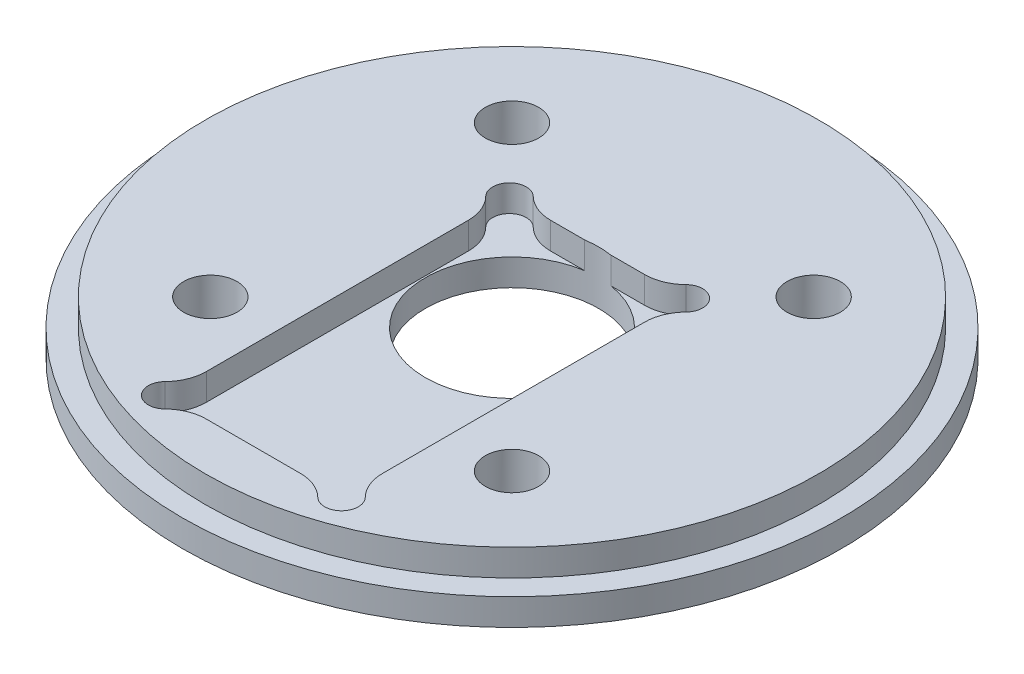
ISO-10303-21;
HEADER;
FILE_DESCRIPTION(('STEP AP214'),'2;1');
FILE_NAME('part.step','',(''),(''),'','','');
FILE_SCHEMA(('AUTOMOTIVE_DESIGN { 1 0 10303 214 1 1 1 1 }'));
ENDSEC;
DATA;
#1=APPLICATION_CONTEXT('core data for automotive mechanical design processes');
#2=APPLICATION_PROTOCOL_DEFINITION('international standard','automotive_design',2000,#1);
#3=PRODUCT_CONTEXT('',#1,'mechanical');
#4=PRODUCT('Part','Part','',(#3));
#5=PRODUCT_RELATED_PRODUCT_CATEGORY('part','',(#4));
#6=PRODUCT_DEFINITION_FORMATION('','',#4);
#7=PRODUCT_DEFINITION_CONTEXT('part definition',#1,'design');
#8=PRODUCT_DEFINITION('design','',#6,#7);
#9=PRODUCT_DEFINITION_SHAPE('','',#8);
#10=(LENGTH_UNIT() NAMED_UNIT(*) SI_UNIT(.MILLI.,.METRE.));
#11=(NAMED_UNIT(*) PLANE_ANGLE_UNIT() SI_UNIT($,.RADIAN.));
#12=(NAMED_UNIT(*) SI_UNIT($,.STERADIAN.) SOLID_ANGLE_UNIT());
#13=UNCERTAINTY_MEASURE_WITH_UNIT(LENGTH_MEASURE(1.E-05),#10,'distance_accuracy_value','');
#14=(GEOMETRIC_REPRESENTATION_CONTEXT(3) GLOBAL_UNCERTAINTY_ASSIGNED_CONTEXT((#13)) GLOBAL_UNIT_ASSIGNED_CONTEXT((#10,
#11,#12)) REPRESENTATION_CONTEXT('',''));
#15=CARTESIAN_POINT('',(0.,0.,0.));
#16=DIRECTION('',(0.,0.,1.));
#17=DIRECTION('',(1.,0.,0.));
#18=AXIS2_PLACEMENT_3D('',#15,#16,#17);
#19=CARTESIAN_POINT('',(-17.9605122421381,6.35,-17.9605122421386));
#20=DIRECTION('',(0.,1.,0.));
#21=DIRECTION('',(0.,0.,1.));
#22=AXIS2_PLACEMENT_3D('',#19,#20,#21);
#23=CYLINDRICAL_SURFACE('',#22,3.175);
#24=CARTESIAN_POINT('',(-17.9605122421381,6.35,-17.9605122421386));
#25=DIRECTION('',(0.,1.,0.));
#26=DIRECTION('',(0.,0.,1.));
#27=AXIS2_PLACEMENT_3D('',#24,#25,#26);
#28=CIRCLE('',#27,3.175);
#29=CARTESIAN_POINT('',(-17.9605122421381,6.35,-14.7855122421386));
#30=VERTEX_POINT('',#29);
#31=EDGE_CURVE('E320',#30,#30,#28,.T.);
#32=ORIENTED_EDGE('',*,*,#31,.T.);
#33=EDGE_LOOP('',(#32));
#34=FACE_BOUND('',#33,.T.);
#35=CARTESIAN_POINT('',(-17.9605122421381,1.5875,-17.9605122421386));
#36=DIRECTION('',(0.,-1.,0.));
#37=DIRECTION('',(0.,0.,-1.));
#38=AXIS2_PLACEMENT_3D('',#35,#36,#37);
#39=CIRCLE('',#38,3.175);
#40=CARTESIAN_POINT('',(-17.9605122421381,1.5875,-21.1355122421386));
#41=VERTEX_POINT('',#40);
#42=EDGE_CURVE('E43',#41,#41,#39,.F.);
#43=ORIENTED_EDGE('',*,*,#42,.F.);
#44=EDGE_LOOP('',(#43));
#45=FACE_BOUND('',#44,.T.);
#46=ADVANCED_FACE('F39',(#34,#45),#23,.F.);
#47=CARTESIAN_POINT('',(17.9605122421384,6.35,17.9605122421382));
#48=DIRECTION('',(0.,1.,0.));
#49=DIRECTION('',(0.,0.,1.));
#50=AXIS2_PLACEMENT_3D('',#47,#48,#49);
#51=CYLINDRICAL_SURFACE('',#50,3.175);
#52=CARTESIAN_POINT('',(17.9605122421384,6.35,17.9605122421382));
#53=DIRECTION('',(0.,1.,0.));
#54=DIRECTION('',(0.,0.,1.));
#55=AXIS2_PLACEMENT_3D('',#52,#53,#54);
#56=CIRCLE('',#55,3.175);
#57=CARTESIAN_POINT('',(17.9605122421384,6.35,21.1355122421382));
#58=VERTEX_POINT('',#57);
#59=EDGE_CURVE('E317',#58,#58,#56,.T.);
#60=ORIENTED_EDGE('',*,*,#59,.T.);
#61=EDGE_LOOP('',(#60));
#62=FACE_BOUND('',#61,.T.);
#63=CARTESIAN_POINT('',(17.9605122421384,1.5875,17.9605122421382));
#64=DIRECTION('',(0.,-1.,0.));
#65=DIRECTION('',(0.,0.,-1.));
#66=AXIS2_PLACEMENT_3D('',#63,#64,#65);
#67=CIRCLE('',#66,3.175);
#68=CARTESIAN_POINT('',(17.9605122421384,1.5875,14.7855122421382));
#69=VERTEX_POINT('',#68);
#70=EDGE_CURVE('E344',#69,#69,#67,.F.);
#71=ORIENTED_EDGE('',*,*,#70,.F.);
#72=EDGE_LOOP('',(#71));
#73=FACE_BOUND('',#72,.T.);
#74=ADVANCED_FACE('F354',(#62,#73),#51,.F.);
#75=CARTESIAN_POINT('',(17.9605122421386,6.35,-17.960512242138));
#76=DIRECTION('',(0.,1.,0.));
#77=DIRECTION('',(0.,0.,1.));
#78=AXIS2_PLACEMENT_3D('',#75,#76,#77);
#79=CYLINDRICAL_SURFACE('',#78,3.175);
#80=CARTESIAN_POINT('',(17.9605122421386,6.35,-17.960512242138));
#81=DIRECTION('',(0.,1.,0.));
#82=DIRECTION('',(0.,0.,1.));
#83=AXIS2_PLACEMENT_3D('',#80,#81,#82);
#84=CIRCLE('',#83,3.175);
#85=CARTESIAN_POINT('',(17.9605122421386,6.35,-14.785512242138));
#86=VERTEX_POINT('',#85);
#87=EDGE_CURVE('E314',#86,#86,#84,.T.);
#88=ORIENTED_EDGE('',*,*,#87,.T.);
#89=EDGE_LOOP('',(#88));
#90=FACE_BOUND('',#89,.T.);
#91=CARTESIAN_POINT('',(17.9605122421386,1.5875,-17.960512242138));
#92=DIRECTION('',(0.,-1.,0.));
#93=DIRECTION('',(0.,0.,-1.));
#94=AXIS2_PLACEMENT_3D('',#91,#92,#93);
#95=CIRCLE('',#94,3.175);
#96=CARTESIAN_POINT('',(17.9605122421386,1.5875,-21.135512242138));
#97=VERTEX_POINT('',#96);
#98=EDGE_CURVE('E341',#97,#97,#95,.F.);
#99=ORIENTED_EDGE('',*,*,#98,.F.);
#100=EDGE_LOOP('',(#99));
#101=FACE_BOUND('',#100,.T.);
#102=ADVANCED_FACE('F361',(#90,#101),#79,.F.);
#103=CARTESIAN_POINT('',(-17.9605122421382,6.35,17.9605122421384));
#104=DIRECTION('',(0.,1.,0.));
#105=DIRECTION('',(0.,0.,1.));
#106=AXIS2_PLACEMENT_3D('',#103,#104,#105);
#107=CYLINDRICAL_SURFACE('',#106,3.175);
#108=CARTESIAN_POINT('',(-17.9605122421382,6.35,17.9605122421384));
#109=DIRECTION('',(0.,1.,0.));
#110=DIRECTION('',(0.,0.,1.));
#111=AXIS2_PLACEMENT_3D('',#108,#109,#110);
#112=CIRCLE('',#111,3.175);
#113=CARTESIAN_POINT('',(-17.9605122421382,6.35,21.1355122421384));
#114=VERTEX_POINT('',#113);
#115=EDGE_CURVE('E311',#114,#114,#112,.T.);
#116=ORIENTED_EDGE('',*,*,#115,.T.);
#117=EDGE_LOOP('',(#116));
#118=FACE_BOUND('',#117,.T.);
#119=CARTESIAN_POINT('',(-17.9605122421382,1.5875,17.9605122421384));
#120=DIRECTION('',(0.,-1.,0.));
#121=DIRECTION('',(0.,0.,-1.));
#122=AXIS2_PLACEMENT_3D('',#119,#120,#121);
#123=CIRCLE('',#122,3.175);
#124=CARTESIAN_POINT('',(-17.9605122421382,1.5875,14.7855122421384));
#125=VERTEX_POINT('',#124);
#126=EDGE_CURVE('E338',#125,#125,#123,.F.);
#127=ORIENTED_EDGE('',*,*,#126,.F.);
#128=EDGE_LOOP('',(#127));
#129=FACE_BOUND('',#128,.T.);
#130=ADVANCED_FACE('F386',(#118,#129),#107,.F.);
#131=CARTESIAN_POINT('',(0.,6.35,0.));
#132=DIRECTION('',(0.,-1.,0.));
#133=DIRECTION('',(0.,0.,-1.));
#134=AXIS2_PLACEMENT_3D('',#131,#132,#133);
#135=CYLINDRICAL_SURFACE('',#134,39.243);
#136=CARTESIAN_POINT('',(0.,0.,0.));
#137=DIRECTION('',(0.,1.,0.));
#138=DIRECTION('',(0.,0.,1.));
#139=AXIS2_PLACEMENT_3D('',#136,#137,#138);
#140=CIRCLE('',#139,39.243);
#141=CARTESIAN_POINT('',(0.,0.,39.243));
#142=VERTEX_POINT('',#141);
#143=EDGE_CURVE('E332',#142,#142,#140,.T.);
#144=ORIENTED_EDGE('',*,*,#143,.T.);
#145=EDGE_LOOP('',(#144));
#146=FACE_BOUND('',#145,.T.);
#147=CARTESIAN_POINT('',(0.,3.175,0.));
#148=DIRECTION('',(0.,1.,0.));
#149=DIRECTION('',(0.,0.,1.));
#150=AXIS2_PLACEMENT_3D('',#147,#148,#149);
#151=CIRCLE('',#150,39.243);
#152=CARTESIAN_POINT('',(0.,3.175,39.243));
#153=VERTEX_POINT('',#152);
#154=EDGE_CURVE('E327',#153,#153,#151,.T.);
#155=ORIENTED_EDGE('',*,*,#154,.F.);
#156=EDGE_LOOP('',(#155));
#157=FACE_BOUND('',#156,.T.);
#158=ADVANCED_FACE('F41',(#146,#157),#135,.T.);
#159=CARTESIAN_POINT('',(0.,0.,0.));
#160=DIRECTION('',(0.,1.,0.));
#161=DIRECTION('',(0.,0.,1.));
#162=AXIS2_PLACEMENT_3D('',#159,#160,#161);
#163=PLANE('',#162);
#164=CARTESIAN_POINT('',(-17.9605122421381,0.,-17.9605122421386));
#165=DIRECTION('',(0.,-1.,0.));
#166=DIRECTION('',(0.,0.,-1.));
#167=AXIS2_PLACEMENT_3D('',#164,#165,#166);
#168=CIRCLE('',#167,6.0325);
#169=CARTESIAN_POINT('',(-17.9605122421381,0.,-23.9930122421386));
#170=VERTEX_POINT('',#169);
#171=EDGE_CURVE('E391',#170,#170,#168,.T.);
#172=ORIENTED_EDGE('',*,*,#171,.F.);
#173=EDGE_LOOP('',(#172));
#174=FACE_BOUND('',#173,.T.);
#175=CARTESIAN_POINT('',(17.9605122421386,0.,-17.960512242138));
#176=DIRECTION('',(0.,-1.,0.));
#177=DIRECTION('',(0.,0.,-1.));
#178=AXIS2_PLACEMENT_3D('',#175,#176,#177);
#179=CIRCLE('',#178,6.0325);
#180=CARTESIAN_POINT('',(17.9605122421386,0.,-23.993012242138));
#181=VERTEX_POINT('',#180);
#182=EDGE_CURVE('E395',#181,#181,#179,.T.);
#183=ORIENTED_EDGE('',*,*,#182,.F.);
#184=EDGE_LOOP('',(#183));
#185=FACE_BOUND('',#184,.T.);
#186=CARTESIAN_POINT('',(17.9605122421384,0.,17.9605122421382));
#187=DIRECTION('',(0.,-1.,0.));
#188=DIRECTION('',(0.,0.,-1.));
#189=AXIS2_PLACEMENT_3D('',#186,#187,#188);
#190=CIRCLE('',#189,6.0325);
#191=CARTESIAN_POINT('',(17.9605122421384,0.,11.9280122421382));
#192=VERTEX_POINT('',#191);
#193=EDGE_CURVE('E399',#192,#192,#190,.T.);
#194=ORIENTED_EDGE('',*,*,#193,.F.);
#195=EDGE_LOOP('',(#194));
#196=FACE_BOUND('',#195,.T.);
#197=CARTESIAN_POINT('',(-17.9605122421382,0.,17.9605122421384));
#198=DIRECTION('',(0.,-1.,0.));
#199=DIRECTION('',(0.,0.,-1.));
#200=AXIS2_PLACEMENT_3D('',#197,#198,#199);
#201=CIRCLE('',#200,6.0325);
#202=CARTESIAN_POINT('',(-17.9605122421382,0.,11.9280122421384));
#203=VERTEX_POINT('',#202);
#204=EDGE_CURVE('E196',#203,#203,#201,.T.);
#205=ORIENTED_EDGE('',*,*,#204,.F.);
#206=EDGE_LOOP('',(#205));
#207=FACE_BOUND('',#206,.T.);
#208=CARTESIAN_POINT('',(0.,0.,0.));
#209=DIRECTION('',(0.,1.,0.));
#210=DIRECTION('',(0.,0.,1.));
#211=AXIS2_PLACEMENT_3D('',#208,#209,#210);
#212=CIRCLE('',#211,10.31875);
#213=CARTESIAN_POINT('',(0.,0.,10.31875));
#214=VERTEX_POINT('',#213);
#215=EDGE_CURVE('E308',#214,#214,#212,.T.);
#216=ORIENTED_EDGE('',*,*,#215,.T.);
#217=EDGE_LOOP('',(#216));
#218=FACE_BOUND('',#217,.T.);
#219=ORIENTED_EDGE('',*,*,#143,.F.);
#220=EDGE_LOOP('',(#219));
#221=FACE_BOUND('',#220,.T.);
#222=ADVANCED_FACE('F374',(#174,#185,#196,#207,#218,#221),#163,.F.);
#223=CARTESIAN_POINT('',(0.,3.175,0.));
#224=DIRECTION('',(0.,1.,0.));
#225=DIRECTION('',(0.,0.,1.));
#226=AXIS2_PLACEMENT_3D('',#223,#224,#225);
#227=PLANE('',#226);
#228=CARTESIAN_POINT('',(0.,3.175,0.));
#229=DIRECTION('',(0.,1.,0.));
#230=DIRECTION('',(0.,0.,1.));
#231=AXIS2_PLACEMENT_3D('',#228,#229,#230);
#232=CIRCLE('',#231,36.5125);
#233=CARTESIAN_POINT('',(0.,3.175,36.5125));
#234=VERTEX_POINT('',#233);
#235=EDGE_CURVE('E324',#234,#234,#232,.T.);
#236=ORIENTED_EDGE('',*,*,#235,.F.);
#237=EDGE_LOOP('',(#236));
#238=FACE_BOUND('',#237,.T.);
#239=ORIENTED_EDGE('',*,*,#154,.T.);
#240=EDGE_LOOP('',(#239));
#241=FACE_BOUND('',#240,.T.);
#242=ADVANCED_FACE('F370',(#238,#241),#227,.T.);
#243=CARTESIAN_POINT('',(0.,3.175,0.));
#244=DIRECTION('',(0.,1.,0.));
#245=DIRECTION('',(0.,0.,1.));
#246=AXIS2_PLACEMENT_3D('',#243,#244,#245);
#247=CYLINDRICAL_SURFACE('',#246,36.5125);
#248=ORIENTED_EDGE('',*,*,#235,.T.);
#249=EDGE_LOOP('',(#248));
#250=FACE_BOUND('',#249,.T.);
#251=CARTESIAN_POINT('',(0.,6.35,0.));
#252=DIRECTION('',(0.,1.,0.));
#253=DIRECTION('',(0.,0.,1.));
#254=AXIS2_PLACEMENT_3D('',#251,#252,#253);
#255=CIRCLE('',#254,36.5125);
#256=CARTESIAN_POINT('',(0.,6.35,36.5125));
#257=VERTEX_POINT('',#256);
#258=EDGE_CURVE('E323',#257,#257,#255,.T.);
#259=ORIENTED_EDGE('',*,*,#258,.F.);
#260=EDGE_LOOP('',(#259));
#261=FACE_BOUND('',#260,.T.);
#262=ADVANCED_FACE('F366',(#250,#261),#247,.T.);
#263=CARTESIAN_POINT('',(0.,6.35,0.));
#264=DIRECTION('',(0.,1.,0.));
#265=DIRECTION('',(0.,0.,1.));
#266=AXIS2_PLACEMENT_3D('',#263,#264,#265);
#267=PLANE('',#266);
#268=DIRECTION('',(-1.,0.,0.));
#269=VECTOR('',#268,1.);
#270=CARTESIAN_POINT('',(-5.60102051443364,6.35,-10.2));
#271=LINE('',#270,#269);
#272=CARTESIAN_POINT('',(-1.56096174280472,6.35,-10.2));
#273=VERTEX_POINT('',#272);
#274=CARTESIAN_POINT('',(-5.60102051443364,6.35,-10.2));
#275=VERTEX_POINT('',#274);
#276=EDGE_CURVE('E264',#273,#275,#271,.T.);
#277=ORIENTED_EDGE('',*,*,#276,.F.);
#278=CARTESIAN_POINT('',(0.,6.35,0.));
#279=DIRECTION('',(0.,1.,0.));
#280=DIRECTION('',(0.,0.,1.));
#281=AXIS2_PLACEMENT_3D('',#278,#279,#280);
#282=CIRCLE('',#281,10.31875);
#283=CARTESIAN_POINT('',(1.56096174280472,6.35,-10.2));
#284=VERTEX_POINT('',#283);
#285=EDGE_CURVE('E277',#284,#273,#282,.T.);
#286=ORIENTED_EDGE('',*,*,#285,.F.);
#287=CARTESIAN_POINT('',(5.60102051443364,6.35,-10.2));
#288=VERTEX_POINT('',#287);
#289=EDGE_CURVE('E265',#288,#284,#271,.T.);
#290=ORIENTED_EDGE('',*,*,#289,.F.);
#291=CARTESIAN_POINT('',(5.60102051443364,6.35,-15.2));
#292=DIRECTION('',(0.,-1.,0.));
#293=DIRECTION('',(0.,0.,-1.));
#294=AXIS2_PLACEMENT_3D('',#291,#292,#293);
#295=CIRCLE('',#294,5.);
#296=CARTESIAN_POINT('',(9.10029157555247,6.35,-11.6285714285714));
#297=VERTEX_POINT('',#296);
#298=EDGE_CURVE('E261',#297,#288,#295,.T.);
#299=ORIENTED_EDGE('',*,*,#298,.F.);
#300=CARTESIAN_POINT('',(10.5,6.35,-10.2));
#301=DIRECTION('',(0.,1.,0.));
#302=DIRECTION('',(0.,0.,1.));
#303=AXIS2_PLACEMENT_3D('',#300,#301,#302);
#304=CIRCLE('',#303,2.);
#305=CARTESIAN_POINT('',(11.9285714285714,6.35,-8.80029157555247));
#306=VERTEX_POINT('',#305);
#307=EDGE_CURVE('E258',#306,#297,#304,.T.);
#308=ORIENTED_EDGE('',*,*,#307,.F.);
#309=CARTESIAN_POINT('',(15.5,6.35,-5.30102051443365));
#310=DIRECTION('',(0.,-1.,0.));
#311=DIRECTION('',(0.,0.,1.));
#312=AXIS2_PLACEMENT_3D('',#309,#310,#311);
#313=CIRCLE('',#312,5.);
#314=CARTESIAN_POINT('',(10.5,6.35,-5.30102051443365));
#315=VERTEX_POINT('',#314);
#316=EDGE_CURVE('E255',#315,#306,#313,.T.);
#317=ORIENTED_EDGE('',*,*,#316,.F.);
#318=DIRECTION('',(0.,0.,-1.));
#319=VECTOR('',#318,1.);
#320=CARTESIAN_POINT('',(10.5,6.35,-5.30102051443365));
#321=LINE('',#320,#319);
#322=CARTESIAN_POINT('',(10.5,6.35,25.9010205144336));
#323=VERTEX_POINT('',#322);
#324=EDGE_CURVE('E252',#323,#315,#321,.T.);
#325=ORIENTED_EDGE('',*,*,#324,.F.);
#326=CARTESIAN_POINT('',(15.5,6.35,25.9010205144336));
#327=DIRECTION('',(0.,-1.,0.));
#328=DIRECTION('',(0.,0.,-1.));
#329=AXIS2_PLACEMENT_3D('',#326,#327,#328);
#330=CIRCLE('',#329,5.);
#331=CARTESIAN_POINT('',(11.9285714285714,6.35,29.4002915755525));
#332=VERTEX_POINT('',#331);
#333=EDGE_CURVE('E249',#332,#323,#330,.T.);
#334=ORIENTED_EDGE('',*,*,#333,.F.);
#335=CARTESIAN_POINT('',(10.5,6.35,30.8));
#336=DIRECTION('',(0.,1.,0.));
#337=DIRECTION('',(0.,0.,-1.));
#338=AXIS2_PLACEMENT_3D('',#335,#336,#337);
#339=CIRCLE('',#338,2.);
#340=CARTESIAN_POINT('',(9.10029157555247,6.35,32.2285714285714));
#341=VERTEX_POINT('',#340);
#342=EDGE_CURVE('E246',#341,#332,#339,.T.);
#343=ORIENTED_EDGE('',*,*,#342,.F.);
#344=CARTESIAN_POINT('',(5.60102051443364,6.35,35.8));
#345=DIRECTION('',(0.,-1.,0.));
#346=DIRECTION('',(0.,0.,1.));
#347=AXIS2_PLACEMENT_3D('',#344,#345,#346);
#348=CIRCLE('',#347,5.);
#349=CARTESIAN_POINT('',(5.60102051443364,6.35,30.8));
#350=VERTEX_POINT('',#349);
#351=EDGE_CURVE('E243',#350,#341,#348,.T.);
#352=ORIENTED_EDGE('',*,*,#351,.F.);
#353=DIRECTION('',(1.,0.,0.));
#354=VECTOR('',#353,1.);
#355=CARTESIAN_POINT('',(-5.60102051443364,6.35,30.8));
#356=LINE('',#355,#354);
#357=CARTESIAN_POINT('',(-5.60102051443364,6.35,30.8));
#358=VERTEX_POINT('',#357);
#359=EDGE_CURVE('E240',#358,#350,#356,.T.);
#360=ORIENTED_EDGE('',*,*,#359,.F.);
#361=CARTESIAN_POINT('',(-5.60102051443364,6.35,35.8));
#362=DIRECTION('',(0.,-1.,0.));
#363=DIRECTION('',(0.,0.,-1.));
#364=AXIS2_PLACEMENT_3D('',#361,#362,#363);
#365=CIRCLE('',#364,5.);
#366=CARTESIAN_POINT('',(-9.10029157555246,6.35,32.2285714285714));
#367=VERTEX_POINT('',#366);
#368=EDGE_CURVE('E237',#367,#358,#365,.T.);
#369=ORIENTED_EDGE('',*,*,#368,.F.);
#370=CARTESIAN_POINT('',(-10.5,6.35,30.8));
#371=DIRECTION('',(0.,1.,0.));
#372=DIRECTION('',(0.,0.,1.));
#373=AXIS2_PLACEMENT_3D('',#370,#371,#372);
#374=CIRCLE('',#373,2.);
#375=CARTESIAN_POINT('',(-11.9285714285714,6.35,29.4002915755525));
#376=VERTEX_POINT('',#375);
#377=EDGE_CURVE('E235',#376,#367,#374,.T.);
#378=ORIENTED_EDGE('',*,*,#377,.F.);
#379=CARTESIAN_POINT('',(-15.5,6.35,25.9010205144336));
#380=DIRECTION('',(0.,-1.,0.));
#381=DIRECTION('',(0.,0.,1.));
#382=AXIS2_PLACEMENT_3D('',#379,#380,#381);
#383=CIRCLE('',#382,5.);
#384=CARTESIAN_POINT('',(-10.5,6.35,25.9010205144336));
#385=VERTEX_POINT('',#384);
#386=EDGE_CURVE('E173',#385,#376,#383,.T.);
#387=ORIENTED_EDGE('',*,*,#386,.F.);
#388=DIRECTION('',(0.,0.,1.));
#389=VECTOR('',#388,1.);
#390=CARTESIAN_POINT('',(-10.5,6.35,-5.30102051443365));
#391=LINE('',#390,#389);
#392=CARTESIAN_POINT('',(-10.5,6.35,-5.30102051443365));
#393=VERTEX_POINT('',#392);
#394=EDGE_CURVE('E190',#393,#385,#391,.T.);
#395=ORIENTED_EDGE('',*,*,#394,.F.);
#396=CARTESIAN_POINT('',(-15.5,6.35,-5.30102051443365));
#397=DIRECTION('',(0.,-1.,0.));
#398=DIRECTION('',(0.,0.,-1.));
#399=AXIS2_PLACEMENT_3D('',#396,#397,#398);
#400=CIRCLE('',#399,5.);
#401=CARTESIAN_POINT('',(-11.9285714285714,6.35,-8.80029157555247));
#402=VERTEX_POINT('',#401);
#403=EDGE_CURVE('E193',#402,#393,#400,.T.);
#404=ORIENTED_EDGE('',*,*,#403,.F.);
#405=CARTESIAN_POINT('',(-10.5,6.35,-10.2));
#406=DIRECTION('',(0.,1.,0.));
#407=DIRECTION('',(0.,0.,-1.));
#408=AXIS2_PLACEMENT_3D('',#405,#406,#407);
#409=CIRCLE('',#408,2.);
#410=CARTESIAN_POINT('',(-9.10029157555247,6.35,-11.6285714285714));
#411=VERTEX_POINT('',#410);
#412=EDGE_CURVE('E270',#411,#402,#409,.T.);
#413=ORIENTED_EDGE('',*,*,#412,.F.);
#414=CARTESIAN_POINT('',(-5.60102051443364,6.35,-15.2));
#415=DIRECTION('',(0.,-1.,0.));
#416=DIRECTION('',(0.,0.,1.));
#417=AXIS2_PLACEMENT_3D('',#414,#415,#416);
#418=CIRCLE('',#417,5.);
#419=EDGE_CURVE('E267',#275,#411,#418,.T.);
#420=ORIENTED_EDGE('',*,*,#419,.F.);
#421=EDGE_LOOP('',(#277,#286,#290,#299,#308,#317,#325,#334,#343,#352,#360,#369,#378,#387,#395,
#404,#413,#420));
#422=FACE_BOUND('',#421,.T.);
#423=ORIENTED_EDGE('',*,*,#115,.F.);
#424=EDGE_LOOP('',(#423));
#425=FACE_BOUND('',#424,.T.);
#426=ORIENTED_EDGE('',*,*,#87,.F.);
#427=EDGE_LOOP('',(#426));
#428=FACE_BOUND('',#427,.T.);
#429=ORIENTED_EDGE('',*,*,#59,.F.);
#430=EDGE_LOOP('',(#429));
#431=FACE_BOUND('',#430,.T.);
#432=ORIENTED_EDGE('',*,*,#31,.F.);
#433=EDGE_LOOP('',(#432));
#434=FACE_BOUND('',#433,.T.);
#435=ORIENTED_EDGE('',*,*,#258,.T.);
#436=EDGE_LOOP('',(#435));
#437=FACE_BOUND('',#436,.T.);
#438=ADVANCED_FACE('F369',(#422,#425,#428,#431,#434,#437),#267,.T.);
#439=CARTESIAN_POINT('',(0.,6.35,0.));
#440=DIRECTION('',(0.,1.,0.));
#441=DIRECTION('',(0.,0.,1.));
#442=AXIS2_PLACEMENT_3D('',#439,#440,#441);
#443=CYLINDRICAL_SURFACE('',#442,10.31875);
#444=ORIENTED_EDGE('',*,*,#285,.T.);
#445=DIRECTION('',(0.,1.,0.));
#446=VECTOR('',#445,1.);
#447=CARTESIAN_POINT('',(-1.56096174280472,6.35,-10.2));
#448=LINE('',#447,#446);
#449=CARTESIAN_POINT('',(-1.56096174280472,3.175,-10.2));
#450=VERTEX_POINT('',#449);
#451=EDGE_CURVE('E11',#273,#450,#448,.F.);
#452=ORIENTED_EDGE('',*,*,#451,.T.);
#453=CARTESIAN_POINT('',(0.,3.175,0.));
#454=DIRECTION('',(0.,1.,0.));
#455=DIRECTION('',(0.,0.,1.));
#456=AXIS2_PLACEMENT_3D('',#453,#454,#455);
#457=CIRCLE('',#456,10.31875);
#458=CARTESIAN_POINT('',(1.56096174280472,3.175,-10.2));
#459=VERTEX_POINT('',#458);
#460=EDGE_CURVE('E61',#459,#450,#457,.F.);
#461=ORIENTED_EDGE('',*,*,#460,.F.);
#462=DIRECTION('',(0.,1.,0.));
#463=VECTOR('',#462,1.);
#464=CARTESIAN_POINT('',(1.56096174280472,6.35,-10.2));
#465=LINE('',#464,#463);
#466=EDGE_CURVE('E48',#459,#284,#465,.T.);
#467=ORIENTED_EDGE('',*,*,#466,.T.);
#468=EDGE_LOOP('',(#444,#452,#461,#467));
#469=FACE_BOUND('',#468,.T.);
#470=ORIENTED_EDGE('',*,*,#215,.F.);
#471=EDGE_LOOP('',(#470));
#472=FACE_BOUND('',#471,.T.);
#473=ADVANCED_FACE('F377',(#469,#472),#443,.F.);
#474=CARTESIAN_POINT('',(-5.60102051443364,3.175,-10.2));
#475=DIRECTION('',(0.,0.,-1.));
#476=DIRECTION('',(-1.,0.,0.));
#477=AXIS2_PLACEMENT_3D('',#474,#475,#476);
#478=PLANE('',#477);
#479=ORIENTED_EDGE('',*,*,#276,.T.);
#480=DIRECTION('',(0.,1.,0.));
#481=VECTOR('',#480,1.);
#482=CARTESIAN_POINT('',(-5.60102051443364,3.175,-10.2));
#483=LINE('',#482,#481);
#484=CARTESIAN_POINT('',(-5.60102051443364,3.175,-10.2));
#485=VERTEX_POINT('',#484);
#486=EDGE_CURVE('E284',#485,#275,#483,.T.);
#487=ORIENTED_EDGE('',*,*,#486,.F.);
#488=DIRECTION('',(-1.,0.,0.));
#489=VECTOR('',#488,1.);
#490=CARTESIAN_POINT('',(-5.60102051443364,3.175,-10.2));
#491=LINE('',#490,#489);
#492=EDGE_CURVE('E223',#450,#485,#491,.T.);
#493=ORIENTED_EDGE('',*,*,#492,.F.);
#494=ORIENTED_EDGE('',*,*,#451,.F.);
#495=EDGE_LOOP('',(#479,#487,#493,#494));
#496=FACE_BOUND('',#495,.T.);
#497=ADVANCED_FACE('F411',(#496),#478,.F.);
#498=CARTESIAN_POINT('',(5.60102051443364,3.175,-10.2));
#499=VERTEX_POINT('',#498);
#500=EDGE_CURVE('E56',#499,#459,#491,.T.);
#501=ORIENTED_EDGE('',*,*,#500,.F.);
#502=DIRECTION('',(0.,1.,0.));
#503=VECTOR('',#502,1.);
#504=CARTESIAN_POINT('',(5.60102051443364,3.175,-10.2));
#505=LINE('',#504,#503);
#506=EDGE_CURVE('E287',#499,#288,#505,.T.);
#507=ORIENTED_EDGE('',*,*,#506,.T.);
#508=ORIENTED_EDGE('',*,*,#289,.T.);
#509=ORIENTED_EDGE('',*,*,#466,.F.);
#510=EDGE_LOOP('',(#501,#507,#508,#509));
#511=FACE_BOUND('',#510,.T.);
#512=ADVANCED_FACE('F417',(#511),#478,.F.);
#513=CARTESIAN_POINT('',(-15.5,3.175,25.9010205144336));
#514=DIRECTION('',(0.,1.,0.));
#515=DIRECTION('',(0.,0.,1.));
#516=AXIS2_PLACEMENT_3D('',#513,#514,#515);
#517=PLANE('',#516);
#518=ORIENTED_EDGE('',*,*,#460,.T.);
#519=ORIENTED_EDGE('',*,*,#492,.T.);
#520=CARTESIAN_POINT('',(-5.60102051443364,3.175,-15.2));
#521=DIRECTION('',(0.,-1.,0.));
#522=DIRECTION('',(0.,0.,1.));
#523=AXIS2_PLACEMENT_3D('',#520,#521,#522);
#524=CIRCLE('',#523,5.);
#525=CARTESIAN_POINT('',(-9.10029157555247,3.175,-11.6285714285714));
#526=VERTEX_POINT('',#525);
#527=EDGE_CURVE('E225',#485,#526,#524,.T.);
#528=ORIENTED_EDGE('',*,*,#527,.T.);
#529=CARTESIAN_POINT('',(-10.5,3.175,-10.2));
#530=DIRECTION('',(0.,1.,0.));
#531=DIRECTION('',(0.,0.,-1.));
#532=AXIS2_PLACEMENT_3D('',#529,#530,#531);
#533=CIRCLE('',#532,2.);
#534=CARTESIAN_POINT('',(-11.9285714285714,3.175,-8.80029157555247));
#535=VERTEX_POINT('',#534);
#536=EDGE_CURVE('E228',#526,#535,#533,.T.);
#537=ORIENTED_EDGE('',*,*,#536,.T.);
#538=CARTESIAN_POINT('',(-15.5,3.175,-5.30102051443365));
#539=DIRECTION('',(0.,-1.,0.));
#540=DIRECTION('',(0.,0.,-1.));
#541=AXIS2_PLACEMENT_3D('',#538,#539,#540);
#542=CIRCLE('',#541,5.);
#543=CARTESIAN_POINT('',(-10.5,3.175,-5.30102051443365));
#544=VERTEX_POINT('',#543);
#545=EDGE_CURVE('E231',#535,#544,#542,.T.);
#546=ORIENTED_EDGE('',*,*,#545,.T.);
#547=DIRECTION('',(0.,0.,1.));
#548=VECTOR('',#547,1.);
#549=CARTESIAN_POINT('',(-10.5,3.175,-5.30102051443365));
#550=LINE('',#549,#548);
#551=CARTESIAN_POINT('',(-10.5,3.175,25.9010205144336));
#552=VERTEX_POINT('',#551);
#553=EDGE_CURVE('E178',#544,#552,#550,.T.);
#554=ORIENTED_EDGE('',*,*,#553,.T.);
#555=CARTESIAN_POINT('',(-15.5,3.175,25.9010205144336));
#556=DIRECTION('',(0.,-1.,0.));
#557=DIRECTION('',(0.,0.,1.));
#558=AXIS2_PLACEMENT_3D('',#555,#556,#557);
#559=CIRCLE('',#558,5.);
#560=CARTESIAN_POINT('',(-11.9285714285714,3.175,29.4002915755525));
#561=VERTEX_POINT('',#560);
#562=EDGE_CURVE('E170',#552,#561,#559,.T.);
#563=ORIENTED_EDGE('',*,*,#562,.T.);
#564=CARTESIAN_POINT('',(-10.5,3.175,30.8));
#565=DIRECTION('',(0.,1.,0.));
#566=DIRECTION('',(0.,0.,1.));
#567=AXIS2_PLACEMENT_3D('',#564,#565,#566);
#568=CIRCLE('',#567,2.);
#569=CARTESIAN_POINT('',(-9.10029157555246,3.175,32.2285714285714));
#570=VERTEX_POINT('',#569);
#571=EDGE_CURVE('E181',#561,#570,#568,.T.);
#572=ORIENTED_EDGE('',*,*,#571,.T.);
#573=CARTESIAN_POINT('',(-5.60102051443364,3.175,35.8));
#574=DIRECTION('',(0.,-1.,0.));
#575=DIRECTION('',(0.,0.,-1.));
#576=AXIS2_PLACEMENT_3D('',#573,#574,#575);
#577=CIRCLE('',#576,5.);
#578=CARTESIAN_POINT('',(-5.60102051443364,3.175,30.8));
#579=VERTEX_POINT('',#578);
#580=EDGE_CURVE('E185',#570,#579,#577,.T.);
#581=ORIENTED_EDGE('',*,*,#580,.T.);
#582=DIRECTION('',(1.,0.,0.));
#583=VECTOR('',#582,1.);
#584=CARTESIAN_POINT('',(-5.60102051443364,3.175,30.8));
#585=LINE('',#584,#583);
#586=CARTESIAN_POINT('',(5.60102051443364,3.175,30.8));
#587=VERTEX_POINT('',#586);
#588=EDGE_CURVE('E200',#579,#587,#585,.T.);
#589=ORIENTED_EDGE('',*,*,#588,.T.);
#590=CARTESIAN_POINT('',(5.60102051443364,3.175,35.8));
#591=DIRECTION('',(0.,-1.,0.));
#592=DIRECTION('',(0.,0.,1.));
#593=AXIS2_PLACEMENT_3D('',#590,#591,#592);
#594=CIRCLE('',#593,5.);
#595=CARTESIAN_POINT('',(9.10029157555247,3.175,32.2285714285714));
#596=VERTEX_POINT('',#595);
#597=EDGE_CURVE('E203',#587,#596,#594,.T.);
#598=ORIENTED_EDGE('',*,*,#597,.T.);
#599=CARTESIAN_POINT('',(10.5,3.175,30.8));
#600=DIRECTION('',(0.,1.,0.));
#601=DIRECTION('',(0.,0.,-1.));
#602=AXIS2_PLACEMENT_3D('',#599,#600,#601);
#603=CIRCLE('',#602,2.);
#604=CARTESIAN_POINT('',(11.9285714285714,3.175,29.4002915755525));
#605=VERTEX_POINT('',#604);
#606=EDGE_CURVE('E206',#596,#605,#603,.T.);
#607=ORIENTED_EDGE('',*,*,#606,.T.);
#608=CARTESIAN_POINT('',(15.5,3.175,25.9010205144336));
#609=DIRECTION('',(0.,-1.,0.));
#610=DIRECTION('',(0.,0.,-1.));
#611=AXIS2_PLACEMENT_3D('',#608,#609,#610);
#612=CIRCLE('',#611,5.);
#613=CARTESIAN_POINT('',(10.5,3.175,25.9010205144336));
#614=VERTEX_POINT('',#613);
#615=EDGE_CURVE('E209',#605,#614,#612,.T.);
#616=ORIENTED_EDGE('',*,*,#615,.T.);
#617=DIRECTION('',(0.,0.,-1.));
#618=VECTOR('',#617,1.);
#619=CARTESIAN_POINT('',(10.5,3.175,-5.30102051443365));
#620=LINE('',#619,#618);
#621=CARTESIAN_POINT('',(10.5,3.175,-5.30102051443365));
#622=VERTEX_POINT('',#621);
#623=EDGE_CURVE('E212',#614,#622,#620,.T.);
#624=ORIENTED_EDGE('',*,*,#623,.T.);
#625=CARTESIAN_POINT('',(15.5,3.175,-5.30102051443365));
#626=DIRECTION('',(0.,-1.,0.));
#627=DIRECTION('',(0.,0.,1.));
#628=AXIS2_PLACEMENT_3D('',#625,#626,#627);
#629=CIRCLE('',#628,5.);
#630=CARTESIAN_POINT('',(11.9285714285714,3.175,-8.80029157555247));
#631=VERTEX_POINT('',#630);
#632=EDGE_CURVE('E215',#622,#631,#629,.T.);
#633=ORIENTED_EDGE('',*,*,#632,.T.);
#634=CARTESIAN_POINT('',(10.5,3.175,-10.2));
#635=DIRECTION('',(0.,1.,0.));
#636=DIRECTION('',(0.,0.,1.));
#637=AXIS2_PLACEMENT_3D('',#634,#635,#636);
#638=CIRCLE('',#637,2.);
#639=CARTESIAN_POINT('',(9.10029157555247,3.175,-11.6285714285714));
#640=VERTEX_POINT('',#639);
#641=EDGE_CURVE('E218',#631,#640,#638,.T.);
#642=ORIENTED_EDGE('',*,*,#641,.T.);
#643=CARTESIAN_POINT('',(5.60102051443364,3.175,-15.2));
#644=DIRECTION('',(0.,-1.,0.));
#645=DIRECTION('',(0.,0.,-1.));
#646=AXIS2_PLACEMENT_3D('',#643,#644,#645);
#647=CIRCLE('',#646,5.);
#648=EDGE_CURVE('E221',#640,#499,#647,.T.);
#649=ORIENTED_EDGE('',*,*,#648,.T.);
#650=ORIENTED_EDGE('',*,*,#500,.T.);
#651=EDGE_LOOP('',(#518,#519,#528,#537,#546,#554,#563,#572,#581,#589,#598,#607,#616,#624,#633,
#642,#649,#650));
#652=FACE_BOUND('',#651,.T.);
#653=ADVANCED_FACE('F187',(#652),#517,.T.);
#654=CARTESIAN_POINT('',(-15.5,3.175,25.9010205144336));
#655=DIRECTION('',(0.,1.,0.));
#656=DIRECTION('',(0.,0.,1.));
#657=AXIS2_PLACEMENT_3D('',#654,#655,#656);
#658=CYLINDRICAL_SURFACE('',#657,5.);
#659=ORIENTED_EDGE('',*,*,#386,.T.);
#660=DIRECTION('',(0.,1.,0.));
#661=VECTOR('',#660,1.);
#662=CARTESIAN_POINT('',(-11.9285714285714,3.175,29.4002915755525));
#663=LINE('',#662,#661);
#664=EDGE_CURVE('E166',#561,#376,#663,.T.);
#665=ORIENTED_EDGE('',*,*,#664,.F.);
#666=ORIENTED_EDGE('',*,*,#562,.F.);
#667=DIRECTION('',(0.,1.,0.));
#668=VECTOR('',#667,1.);
#669=CARTESIAN_POINT('',(-10.5,3.175,25.9010205144336));
#670=LINE('',#669,#668);
#671=EDGE_CURVE('E275',#552,#385,#670,.T.);
#672=ORIENTED_EDGE('',*,*,#671,.T.);
#673=EDGE_LOOP('',(#659,#665,#666,#672));
#674=FACE_BOUND('',#673,.T.);
#675=ADVANCED_FACE('F168',(#674),#658,.T.);
#676=CARTESIAN_POINT('',(-10.5,3.175,-5.30102051443365));
#677=DIRECTION('',(-1.,0.,0.));
#678=DIRECTION('',(0.,0.,1.));
#679=AXIS2_PLACEMENT_3D('',#676,#677,#678);
#680=PLANE('',#679);
#681=ORIENTED_EDGE('',*,*,#394,.T.);
#682=ORIENTED_EDGE('',*,*,#671,.F.);
#683=ORIENTED_EDGE('',*,*,#553,.F.);
#684=DIRECTION('',(0.,1.,0.));
#685=VECTOR('',#684,1.);
#686=CARTESIAN_POINT('',(-10.5,3.175,-5.30102051443365));
#687=LINE('',#686,#685);
#688=EDGE_CURVE('E278',#544,#393,#687,.T.);
#689=ORIENTED_EDGE('',*,*,#688,.T.);
#690=EDGE_LOOP('',(#681,#682,#683,#689));
#691=FACE_BOUND('',#690,.T.);
#692=ADVANCED_FACE('F463',(#691),#680,.F.);
#693=CARTESIAN_POINT('',(-15.5,3.175,-5.30102051443365));
#694=DIRECTION('',(0.,1.,0.));
#695=DIRECTION('',(0.,0.,1.));
#696=AXIS2_PLACEMENT_3D('',#693,#694,#695);
#697=CYLINDRICAL_SURFACE('',#696,5.);
#698=ORIENTED_EDGE('',*,*,#403,.T.);
#699=ORIENTED_EDGE('',*,*,#688,.F.);
#700=ORIENTED_EDGE('',*,*,#545,.F.);
#701=DIRECTION('',(0.,1.,0.));
#702=VECTOR('',#701,1.);
#703=CARTESIAN_POINT('',(-11.9285714285714,3.175,-8.80029157555247));
#704=LINE('',#703,#702);
#705=EDGE_CURVE('E280',#535,#402,#704,.T.);
#706=ORIENTED_EDGE('',*,*,#705,.T.);
#707=EDGE_LOOP('',(#698,#699,#700,#706));
#708=FACE_BOUND('',#707,.T.);
#709=ADVANCED_FACE('F466',(#708),#697,.T.);
#710=CARTESIAN_POINT('',(-10.5,3.175,-10.2));
#711=DIRECTION('',(0.,1.,0.));
#712=DIRECTION('',(0.,0.,1.));
#713=AXIS2_PLACEMENT_3D('',#710,#711,#712);
#714=CYLINDRICAL_SURFACE('',#713,2.);
#715=ORIENTED_EDGE('',*,*,#412,.T.);
#716=ORIENTED_EDGE('',*,*,#705,.F.);
#717=ORIENTED_EDGE('',*,*,#536,.F.);
#718=DIRECTION('',(0.,1.,0.));
#719=VECTOR('',#718,1.);
#720=CARTESIAN_POINT('',(-9.10029157555247,3.175,-11.6285714285714));
#721=LINE('',#720,#719);
#722=EDGE_CURVE('E282',#526,#411,#721,.T.);
#723=ORIENTED_EDGE('',*,*,#722,.T.);
#724=EDGE_LOOP('',(#715,#716,#717,#723));
#725=FACE_BOUND('',#724,.T.);
#726=ADVANCED_FACE('F470',(#725),#714,.F.);
#727=CARTESIAN_POINT('',(-5.60102051443364,3.175,-15.2));
#728=DIRECTION('',(0.,1.,0.));
#729=DIRECTION('',(0.,0.,1.));
#730=AXIS2_PLACEMENT_3D('',#727,#728,#729);
#731=CYLINDRICAL_SURFACE('',#730,5.);
#732=ORIENTED_EDGE('',*,*,#419,.T.);
#733=ORIENTED_EDGE('',*,*,#722,.F.);
#734=ORIENTED_EDGE('',*,*,#527,.F.);
#735=ORIENTED_EDGE('',*,*,#486,.T.);
#736=EDGE_LOOP('',(#732,#733,#734,#735));
#737=FACE_BOUND('',#736,.T.);
#738=ADVANCED_FACE('F474',(#737),#731,.T.);
#739=CARTESIAN_POINT('',(5.60102051443364,3.175,-15.2));
#740=DIRECTION('',(0.,1.,0.));
#741=DIRECTION('',(0.,0.,1.));
#742=AXIS2_PLACEMENT_3D('',#739,#740,#741);
#743=CYLINDRICAL_SURFACE('',#742,5.);
#744=ORIENTED_EDGE('',*,*,#298,.T.);
#745=ORIENTED_EDGE('',*,*,#506,.F.);
#746=ORIENTED_EDGE('',*,*,#648,.F.);
#747=DIRECTION('',(0.,1.,0.));
#748=VECTOR('',#747,1.);
#749=CARTESIAN_POINT('',(9.10029157555247,3.175,-11.6285714285714));
#750=LINE('',#749,#748);
#751=EDGE_CURVE('E289',#640,#297,#750,.T.);
#752=ORIENTED_EDGE('',*,*,#751,.T.);
#753=EDGE_LOOP('',(#744,#745,#746,#752));
#754=FACE_BOUND('',#753,.T.);
#755=ADVANCED_FACE('F477',(#754),#743,.T.);
#756=CARTESIAN_POINT('',(10.5,3.175,-10.2));
#757=DIRECTION('',(0.,1.,0.));
#758=DIRECTION('',(0.,0.,1.));
#759=AXIS2_PLACEMENT_3D('',#756,#757,#758);
#760=CYLINDRICAL_SURFACE('',#759,2.);
#761=ORIENTED_EDGE('',*,*,#307,.T.);
#762=ORIENTED_EDGE('',*,*,#751,.F.);
#763=ORIENTED_EDGE('',*,*,#641,.F.);
#764=DIRECTION('',(0.,1.,0.));
#765=VECTOR('',#764,1.);
#766=CARTESIAN_POINT('',(11.9285714285714,3.175,-8.80029157555247));
#767=LINE('',#766,#765);
#768=EDGE_CURVE('E291',#631,#306,#767,.T.);
#769=ORIENTED_EDGE('',*,*,#768,.T.);
#770=EDGE_LOOP('',(#761,#762,#763,#769));
#771=FACE_BOUND('',#770,.T.);
#772=ADVANCED_FACE('F482',(#771),#760,.F.);
#773=CARTESIAN_POINT('',(15.5,3.175,-5.30102051443365));
#774=DIRECTION('',(0.,1.,0.));
#775=DIRECTION('',(0.,0.,1.));
#776=AXIS2_PLACEMENT_3D('',#773,#774,#775);
#777=CYLINDRICAL_SURFACE('',#776,5.);
#778=ORIENTED_EDGE('',*,*,#316,.T.);
#779=ORIENTED_EDGE('',*,*,#768,.F.);
#780=ORIENTED_EDGE('',*,*,#632,.F.);
#781=DIRECTION('',(0.,1.,0.));
#782=VECTOR('',#781,1.);
#783=CARTESIAN_POINT('',(10.5,3.175,-5.30102051443365));
#784=LINE('',#783,#782);
#785=EDGE_CURVE('E293',#622,#315,#784,.T.);
#786=ORIENTED_EDGE('',*,*,#785,.T.);
#787=EDGE_LOOP('',(#778,#779,#780,#786));
#788=FACE_BOUND('',#787,.T.);
#789=ADVANCED_FACE('F486',(#788),#777,.T.);
#790=CARTESIAN_POINT('',(10.5,3.175,-5.30102051443365));
#791=DIRECTION('',(1.,0.,0.));
#792=DIRECTION('',(0.,0.,-1.));
#793=AXIS2_PLACEMENT_3D('',#790,#791,#792);
#794=PLANE('',#793);
#795=ORIENTED_EDGE('',*,*,#324,.T.);
#796=ORIENTED_EDGE('',*,*,#785,.F.);
#797=ORIENTED_EDGE('',*,*,#623,.F.);
#798=DIRECTION('',(0.,1.,0.));
#799=VECTOR('',#798,1.);
#800=CARTESIAN_POINT('',(10.5,3.175,25.9010205144336));
#801=LINE('',#800,#799);
#802=EDGE_CURVE('E295',#614,#323,#801,.T.);
#803=ORIENTED_EDGE('',*,*,#802,.T.);
#804=EDGE_LOOP('',(#795,#796,#797,#803));
#805=FACE_BOUND('',#804,.T.);
#806=ADVANCED_FACE('F490',(#805),#794,.F.);
#807=CARTESIAN_POINT('',(15.5,3.175,25.9010205144336));
#808=DIRECTION('',(0.,1.,0.));
#809=DIRECTION('',(0.,0.,1.));
#810=AXIS2_PLACEMENT_3D('',#807,#808,#809);
#811=CYLINDRICAL_SURFACE('',#810,5.);
#812=ORIENTED_EDGE('',*,*,#333,.T.);
#813=ORIENTED_EDGE('',*,*,#802,.F.);
#814=ORIENTED_EDGE('',*,*,#615,.F.);
#815=DIRECTION('',(0.,1.,0.));
#816=VECTOR('',#815,1.);
#817=CARTESIAN_POINT('',(11.9285714285714,3.175,29.4002915755525));
#818=LINE('',#817,#816);
#819=EDGE_CURVE('E297',#605,#332,#818,.T.);
#820=ORIENTED_EDGE('',*,*,#819,.T.);
#821=EDGE_LOOP('',(#812,#813,#814,#820));
#822=FACE_BOUND('',#821,.T.);
#823=ADVANCED_FACE('F494',(#822),#811,.T.);
#824=CARTESIAN_POINT('',(10.5,3.175,30.8));
#825=DIRECTION('',(0.,1.,0.));
#826=DIRECTION('',(0.,0.,1.));
#827=AXIS2_PLACEMENT_3D('',#824,#825,#826);
#828=CYLINDRICAL_SURFACE('',#827,2.);
#829=ORIENTED_EDGE('',*,*,#342,.T.);
#830=ORIENTED_EDGE('',*,*,#819,.F.);
#831=ORIENTED_EDGE('',*,*,#606,.F.);
#832=DIRECTION('',(0.,1.,0.));
#833=VECTOR('',#832,1.);
#834=CARTESIAN_POINT('',(9.10029157555247,3.175,32.2285714285714));
#835=LINE('',#834,#833);
#836=EDGE_CURVE('E299',#596,#341,#835,.T.);
#837=ORIENTED_EDGE('',*,*,#836,.T.);
#838=EDGE_LOOP('',(#829,#830,#831,#837));
#839=FACE_BOUND('',#838,.T.);
#840=ADVANCED_FACE('F498',(#839),#828,.F.);
#841=CARTESIAN_POINT('',(5.60102051443364,3.175,35.8));
#842=DIRECTION('',(0.,1.,0.));
#843=DIRECTION('',(0.,0.,1.));
#844=AXIS2_PLACEMENT_3D('',#841,#842,#843);
#845=CYLINDRICAL_SURFACE('',#844,5.);
#846=ORIENTED_EDGE('',*,*,#351,.T.);
#847=ORIENTED_EDGE('',*,*,#836,.F.);
#848=ORIENTED_EDGE('',*,*,#597,.F.);
#849=DIRECTION('',(0.,1.,0.));
#850=VECTOR('',#849,1.);
#851=CARTESIAN_POINT('',(5.60102051443364,3.175,30.8));
#852=LINE('',#851,#850);
#853=EDGE_CURVE('E301',#587,#350,#852,.T.);
#854=ORIENTED_EDGE('',*,*,#853,.T.);
#855=EDGE_LOOP('',(#846,#847,#848,#854));
#856=FACE_BOUND('',#855,.T.);
#857=ADVANCED_FACE('F502',(#856),#845,.T.);
#858=CARTESIAN_POINT('',(-5.60102051443364,3.175,30.8));
#859=DIRECTION('',(0.,0.,1.));
#860=DIRECTION('',(1.,0.,0.));
#861=AXIS2_PLACEMENT_3D('',#858,#859,#860);
#862=PLANE('',#861);
#863=ORIENTED_EDGE('',*,*,#359,.T.);
#864=ORIENTED_EDGE('',*,*,#853,.F.);
#865=ORIENTED_EDGE('',*,*,#588,.F.);
#866=DIRECTION('',(0.,1.,0.));
#867=VECTOR('',#866,1.);
#868=CARTESIAN_POINT('',(-5.60102051443364,3.175,30.8));
#869=LINE('',#868,#867);
#870=EDGE_CURVE('E303',#579,#358,#869,.T.);
#871=ORIENTED_EDGE('',*,*,#870,.T.);
#872=EDGE_LOOP('',(#863,#864,#865,#871));
#873=FACE_BOUND('',#872,.T.);
#874=ADVANCED_FACE('F506',(#873),#862,.F.);
#875=CARTESIAN_POINT('',(-5.60102051443364,3.175,35.8));
#876=DIRECTION('',(0.,1.,0.));
#877=DIRECTION('',(0.,0.,1.));
#878=AXIS2_PLACEMENT_3D('',#875,#876,#877);
#879=CYLINDRICAL_SURFACE('',#878,5.);
#880=ORIENTED_EDGE('',*,*,#368,.T.);
#881=ORIENTED_EDGE('',*,*,#870,.F.);
#882=ORIENTED_EDGE('',*,*,#580,.F.);
#883=DIRECTION('',(0.,1.,0.));
#884=VECTOR('',#883,1.);
#885=CARTESIAN_POINT('',(-9.10029157555246,3.175,32.2285714285714));
#886=LINE('',#885,#884);
#887=EDGE_CURVE('E177',#570,#367,#886,.T.);
#888=ORIENTED_EDGE('',*,*,#887,.T.);
#889=EDGE_LOOP('',(#880,#881,#882,#888));
#890=FACE_BOUND('',#889,.T.);
#891=ADVANCED_FACE('F510',(#890),#879,.T.);
#892=CARTESIAN_POINT('',(-10.5,3.175,30.8));
#893=DIRECTION('',(0.,1.,0.));
#894=DIRECTION('',(0.,0.,1.));
#895=AXIS2_PLACEMENT_3D('',#892,#893,#894);
#896=CYLINDRICAL_SURFACE('',#895,2.);
#897=ORIENTED_EDGE('',*,*,#377,.T.);
#898=ORIENTED_EDGE('',*,*,#887,.F.);
#899=ORIENTED_EDGE('',*,*,#571,.F.);
#900=ORIENTED_EDGE('',*,*,#664,.T.);
#901=EDGE_LOOP('',(#897,#898,#899,#900));
#902=FACE_BOUND('',#901,.T.);
#903=ADVANCED_FACE('F182',(#902),#896,.F.);
#904=CARTESIAN_POINT('',(-17.9605122421382,1.5875,17.9605122421384));
#905=DIRECTION('',(0.,-1.,0.));
#906=DIRECTION('',(0.,0.,-1.));
#907=AXIS2_PLACEMENT_3D('',#904,#905,#906);
#908=PLANE('',#907);
#909=CARTESIAN_POINT('',(-17.9605122421382,1.5875,17.9605122421384));
#910=DIRECTION('',(0.,-1.,0.));
#911=DIRECTION('',(0.,0.,-1.));
#912=AXIS2_PLACEMENT_3D('',#909,#910,#911);
#913=CIRCLE('',#912,6.0325);
#914=CARTESIAN_POINT('',(-17.9605122421382,1.5875,11.9280122421384));
#915=VERTEX_POINT('',#914);
#916=EDGE_CURVE('E342',#915,#915,#913,.T.);
#917=ORIENTED_EDGE('',*,*,#916,.T.);
#918=EDGE_LOOP('',(#917));
#919=FACE_BOUND('',#918,.T.);
#920=ORIENTED_EDGE('',*,*,#126,.T.);
#921=EDGE_LOOP('',(#920));
#922=FACE_BOUND('',#921,.T.);
#923=ADVANCED_FACE('F445',(#919,#922),#908,.T.);
#924=CARTESIAN_POINT('',(-17.9605122421382,1.5875,17.9605122421384));
#925=DIRECTION('',(0.,-1.,0.));
#926=DIRECTION('',(0.,0.,-1.));
#927=AXIS2_PLACEMENT_3D('',#924,#925,#926);
#928=CYLINDRICAL_SURFACE('',#927,6.0325);
#929=ORIENTED_EDGE('',*,*,#916,.F.);
#930=EDGE_LOOP('',(#929));
#931=FACE_BOUND('',#930,.T.);
#932=ORIENTED_EDGE('',*,*,#204,.T.);
#933=EDGE_LOOP('',(#932));
#934=FACE_BOUND('',#933,.T.);
#935=ADVANCED_FACE('F435',(#931,#934),#928,.F.);
#936=CARTESIAN_POINT('',(17.9605122421386,1.5875,-17.960512242138));
#937=DIRECTION('',(0.,-1.,0.));
#938=DIRECTION('',(0.,0.,-1.));
#939=AXIS2_PLACEMENT_3D('',#936,#937,#938);
#940=PLANE('',#939);
#941=CARTESIAN_POINT('',(17.9605122421386,1.5875,-17.960512242138));
#942=DIRECTION('',(0.,-1.,0.));
#943=DIRECTION('',(0.,0.,-1.));
#944=AXIS2_PLACEMENT_3D('',#941,#942,#943);
#945=CIRCLE('',#944,6.0325);
#946=CARTESIAN_POINT('',(17.9605122421386,1.5875,-23.993012242138));
#947=VERTEX_POINT('',#946);
#948=EDGE_CURVE('E734',#947,#947,#945,.T.);
#949=ORIENTED_EDGE('',*,*,#948,.T.);
#950=EDGE_LOOP('',(#949));
#951=FACE_BOUND('',#950,.T.);
#952=ORIENTED_EDGE('',*,*,#98,.T.);
#953=EDGE_LOOP('',(#952));
#954=FACE_BOUND('',#953,.T.);
#955=ADVANCED_FACE('F432',(#951,#954),#940,.T.);
#956=CARTESIAN_POINT('',(17.9605122421386,1.5875,-17.960512242138));
#957=DIRECTION('',(0.,-1.,0.));
#958=DIRECTION('',(0.,0.,-1.));
#959=AXIS2_PLACEMENT_3D('',#956,#957,#958);
#960=CYLINDRICAL_SURFACE('',#959,6.0325);
#961=ORIENTED_EDGE('',*,*,#948,.F.);
#962=EDGE_LOOP('',(#961));
#963=FACE_BOUND('',#962,.T.);
#964=ORIENTED_EDGE('',*,*,#182,.T.);
#965=EDGE_LOOP('',(#964));
#966=FACE_BOUND('',#965,.T.);
#967=ADVANCED_FACE('F434',(#963,#966),#960,.F.);
#968=CARTESIAN_POINT('',(17.9605122421384,1.5875,17.9605122421382));
#969=DIRECTION('',(0.,-1.,0.));
#970=DIRECTION('',(0.,0.,-1.));
#971=AXIS2_PLACEMENT_3D('',#968,#969,#970);
#972=PLANE('',#971);
#973=CARTESIAN_POINT('',(17.9605122421384,1.5875,17.9605122421382));
#974=DIRECTION('',(0.,-1.,0.));
#975=DIRECTION('',(0.,0.,-1.));
#976=AXIS2_PLACEMENT_3D('',#973,#974,#975);
#977=CIRCLE('',#976,6.0325);
#978=CARTESIAN_POINT('',(17.9605122421384,1.5875,11.9280122421382));
#979=VERTEX_POINT('',#978);
#980=EDGE_CURVE('E729',#979,#979,#977,.T.);
#981=ORIENTED_EDGE('',*,*,#980,.T.);
#982=EDGE_LOOP('',(#981));
#983=FACE_BOUND('',#982,.T.);
#984=ORIENTED_EDGE('',*,*,#70,.T.);
#985=EDGE_LOOP('',(#984));
#986=FACE_BOUND('',#985,.T.);
#987=ADVANCED_FACE('F442',(#983,#986),#972,.T.);
#988=CARTESIAN_POINT('',(17.9605122421384,1.5875,17.9605122421382));
#989=DIRECTION('',(0.,-1.,0.));
#990=DIRECTION('',(0.,0.,-1.));
#991=AXIS2_PLACEMENT_3D('',#988,#989,#990);
#992=CYLINDRICAL_SURFACE('',#991,6.0325);
#993=ORIENTED_EDGE('',*,*,#980,.F.);
#994=EDGE_LOOP('',(#993));
#995=FACE_BOUND('',#994,.T.);
#996=ORIENTED_EDGE('',*,*,#193,.T.);
#997=EDGE_LOOP('',(#996));
#998=FACE_BOUND('',#997,.T.);
#999=ADVANCED_FACE('F457',(#995,#998),#992,.F.);
#1000=CARTESIAN_POINT('',(-17.9605122421381,1.5875,-17.9605122421386));
#1001=DIRECTION('',(0.,-1.,0.));
#1002=DIRECTION('',(0.,0.,-1.));
#1003=AXIS2_PLACEMENT_3D('',#1000,#1001,#1002);
#1004=PLANE('',#1003);
#1005=CARTESIAN_POINT('',(-17.9605122421381,1.5875,-17.9605122421386));
#1006=DIRECTION('',(0.,-1.,0.));
#1007=DIRECTION('',(0.,0.,-1.));
#1008=AXIS2_PLACEMENT_3D('',#1005,#1006,#1007);
#1009=CIRCLE('',#1008,6.0325);
#1010=CARTESIAN_POINT('',(-17.9605122421381,1.5875,-23.9930122421386));
#1011=VERTEX_POINT('',#1010);
#1012=EDGE_CURVE('E737',#1011,#1011,#1009,.T.);
#1013=ORIENTED_EDGE('',*,*,#1012,.T.);
#1014=EDGE_LOOP('',(#1013));
#1015=FACE_BOUND('',#1014,.T.);
#1016=ORIENTED_EDGE('',*,*,#42,.T.);
#1017=EDGE_LOOP('',(#1016));
#1018=FACE_BOUND('',#1017,.T.);
#1019=ADVANCED_FACE('F351',(#1015,#1018),#1004,.T.);
#1020=CARTESIAN_POINT('',(-17.9605122421381,1.5875,-17.9605122421386));
#1021=DIRECTION('',(0.,-1.,0.));
#1022=DIRECTION('',(0.,0.,-1.));
#1023=AXIS2_PLACEMENT_3D('',#1020,#1021,#1022);
#1024=CYLINDRICAL_SURFACE('',#1023,6.0325);
#1025=ORIENTED_EDGE('',*,*,#1012,.F.);
#1026=EDGE_LOOP('',(#1025));
#1027=FACE_BOUND('',#1026,.T.);
#1028=ORIENTED_EDGE('',*,*,#171,.T.);
#1029=EDGE_LOOP('',(#1028));
#1030=FACE_BOUND('',#1029,.T.);
#1031=ADVANCED_FACE('F451',(#1027,#1030),#1024,.F.);
#1032=CLOSED_SHELL('',(#46,#74,#102,#130,#158,#222,#242,#262,#438,#473,#497,#512,#653,#675,#692,
#709,#726,#738,#755,#772,#789,#806,#823,#840,#857,#874,#891,#903,#923,#935,#955,#967,#987,#999,
#1019,#1031));
#1033=MANIFOLD_SOLID_BREP('B2',#1032);
#1034=ADVANCED_BREP_SHAPE_REPRESENTATION('',(#18,#1033),#14);
#1035=SHAPE_DEFINITION_REPRESENTATION(#9,#1034);
ENDSEC;
END-ISO-10303-21;
